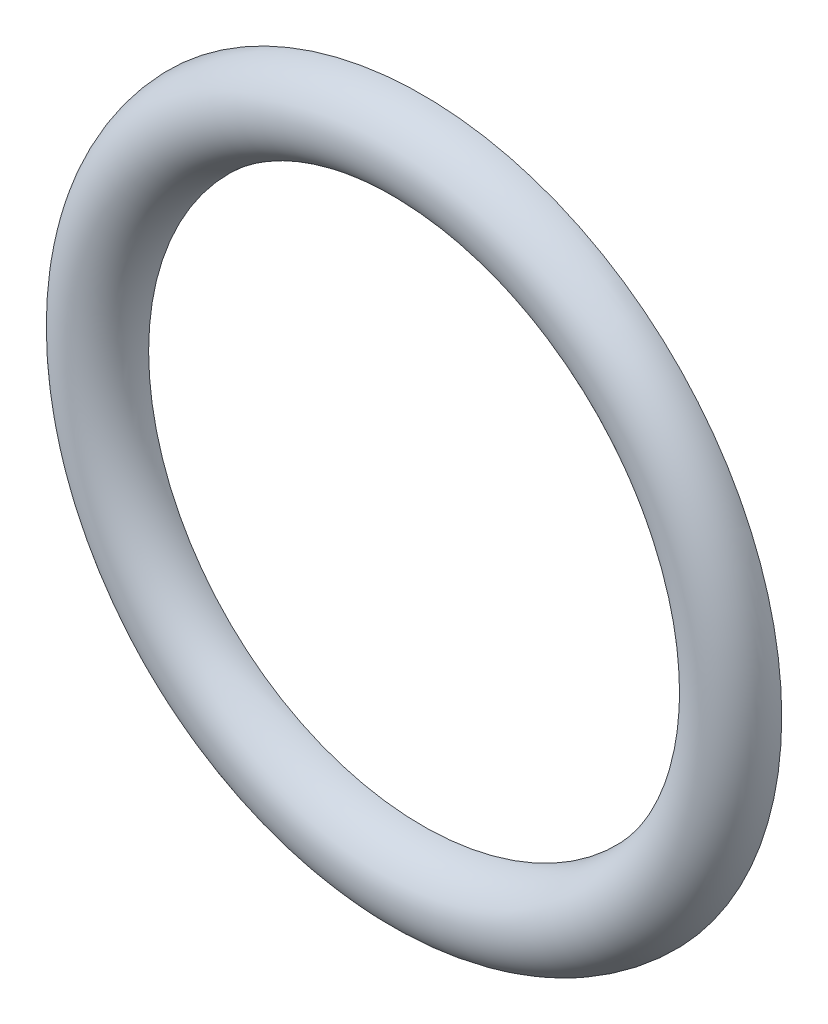
ISO-10303-21;
HEADER;
FILE_DESCRIPTION(('STEP AP214'),'2;1');
FILE_NAME('part.step','',(''),(''),'','','');
FILE_SCHEMA(('AUTOMOTIVE_DESIGN { 1 0 10303 214 1 1 1 1 }'));
ENDSEC;
DATA;
#1=APPLICATION_CONTEXT('core data for automotive mechanical design processes');
#2=APPLICATION_PROTOCOL_DEFINITION('international standard','automotive_design',2000,#1);
#3=PRODUCT_CONTEXT('',#1,'mechanical');
#4=PRODUCT('Part','Part','',(#3));
#5=PRODUCT_RELATED_PRODUCT_CATEGORY('part','',(#4));
#6=PRODUCT_DEFINITION_FORMATION('','',#4);
#7=PRODUCT_DEFINITION_CONTEXT('part definition',#1,'design');
#8=PRODUCT_DEFINITION('design','',#6,#7);
#9=PRODUCT_DEFINITION_SHAPE('','',#8);
#10=(LENGTH_UNIT() NAMED_UNIT(*) SI_UNIT(.MILLI.,.METRE.));
#11=(NAMED_UNIT(*) PLANE_ANGLE_UNIT() SI_UNIT($,.RADIAN.));
#12=(NAMED_UNIT(*) SI_UNIT($,.STERADIAN.) SOLID_ANGLE_UNIT());
#13=UNCERTAINTY_MEASURE_WITH_UNIT(LENGTH_MEASURE(1.E-05),#10,'distance_accuracy_value','');
#14=(GEOMETRIC_REPRESENTATION_CONTEXT(3) GLOBAL_UNCERTAINTY_ASSIGNED_CONTEXT((#13)) GLOBAL_UNIT_ASSIGNED_CONTEXT((#10,
#11,#12)) REPRESENTATION_CONTEXT('',''));
#15=CARTESIAN_POINT('',(0.,0.,0.));
#16=DIRECTION('',(0.,0.,1.));
#17=DIRECTION('',(1.,0.,0.));
#18=AXIS2_PLACEMENT_3D('',#15,#16,#17);
#19=CARTESIAN_POINT('',(-58.9078947368421,0.,0.));
#20=DIRECTION('',(0.,0.,-1.));
#21=DIRECTION('',(-1.,0.,0.));
#22=AXIS2_PLACEMENT_3D('',#19,#20,#21);
#23=TOROIDAL_SURFACE('',#22,112.,15.);
#24=CARTESIAN_POINT('',(-58.9078947368421,0.,0.));
#25=DIRECTION('',(0.,0.,-1.));
#26=DIRECTION('',(-1.,0.,0.));
#27=AXIS2_PLACEMENT_3D('',#24,#25,#26);
#28=CIRCLE('',#27,127.);
#29=CARTESIAN_POINT('',(-185.907894736842,0.,0.));
#30=VERTEX_POINT('',#29);
#31=EDGE_CURVE('E38',#30,#30,#28,.T.);
#32=ORIENTED_EDGE('',*,*,#31,.F.);
#33=EDGE_LOOP('',(#32));
#34=FACE_BOUND('',#33,.T.);
#35=CARTESIAN_POINT('',(-58.9078947368421,0.,0.));
#36=DIRECTION('',(0.,0.,-1.));
#37=DIRECTION('',(-1.,0.,0.));
#38=AXIS2_PLACEMENT_3D('',#35,#36,#37);
#39=CIRCLE('',#38,97.);
#40=CARTESIAN_POINT('',(-155.907894736842,0.,0.));
#41=VERTEX_POINT('',#40);
#42=EDGE_CURVE('E10',#41,#41,#39,.T.);
#43=ORIENTED_EDGE('',*,*,#42,.T.);
#44=EDGE_LOOP('',(#43));
#45=FACE_BOUND('',#44,.T.);
#46=ADVANCED_FACE('F32',(#34,#45),#23,.T.);
#47=CARTESIAN_POINT('',(38.0921052631579,0.,0.));
#48=DIRECTION('',(0.,0.,1.));
#49=DIRECTION('',(1.,0.,0.));
#50=AXIS2_PLACEMENT_3D('',#47,#48,#49);
#51=PLANE('',#50);
#52=ORIENTED_EDGE('',*,*,#42,.F.);
#53=EDGE_LOOP('',(#52));
#54=FACE_BOUND('',#53,.T.);
#55=ORIENTED_EDGE('',*,*,#31,.T.);
#56=EDGE_LOOP('',(#55));
#57=FACE_BOUND('',#56,.T.);
#58=ADVANCED_FACE('F44',(#54,#57),#51,.F.);
#59=CLOSED_SHELL('',(#46,#58));
#60=MANIFOLD_SOLID_BREP('B2',#59);
#61=ADVANCED_BREP_SHAPE_REPRESENTATION('',(#18,#60),#14);
#62=SHAPE_DEFINITION_REPRESENTATION(#9,#61);
ENDSEC;
END-ISO-10303-21;
